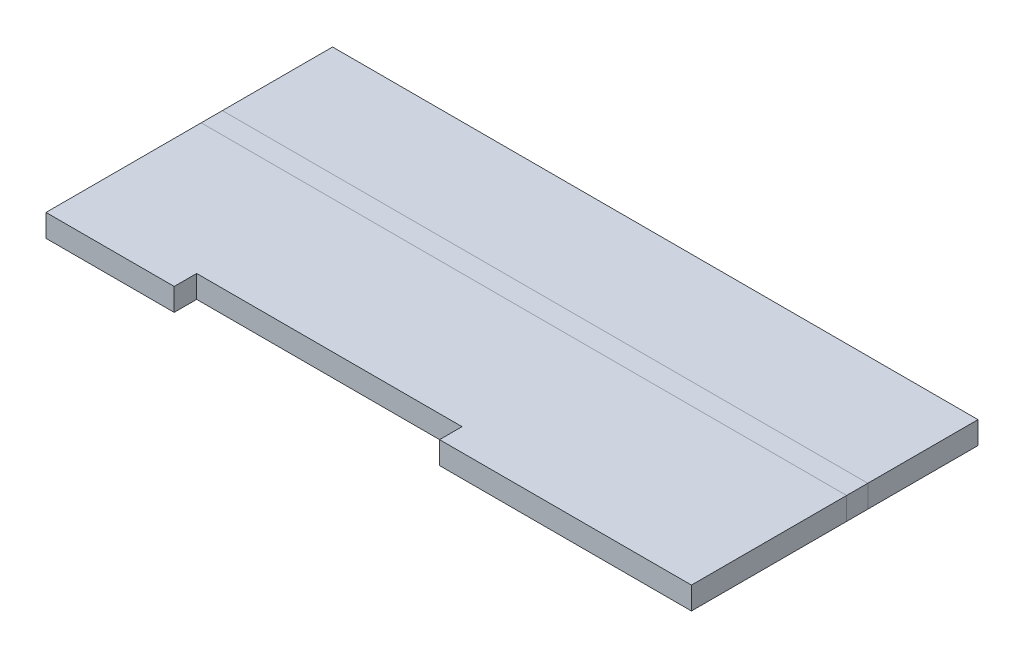
ISO-10303-21;
HEADER;
FILE_DESCRIPTION(('STEP AP214'),'2;1');
FILE_NAME('part.step','',(''),(''),'','','');
FILE_SCHEMA(('AUTOMOTIVE_DESIGN { 1 0 10303 214 1 1 1 1 }'));
ENDSEC;
DATA;
#1=APPLICATION_CONTEXT('core data for automotive mechanical design processes');
#2=APPLICATION_PROTOCOL_DEFINITION('international standard','automotive_design',2000,#1);
#3=PRODUCT_CONTEXT('',#1,'mechanical');
#4=PRODUCT('Part','Part','',(#3));
#5=PRODUCT_RELATED_PRODUCT_CATEGORY('part','',(#4));
#6=PRODUCT_DEFINITION_FORMATION('','',#4);
#7=PRODUCT_DEFINITION_CONTEXT('part definition',#1,'design');
#8=PRODUCT_DEFINITION('design','',#6,#7);
#9=PRODUCT_DEFINITION_SHAPE('','',#8);
#10=(LENGTH_UNIT() NAMED_UNIT(*) SI_UNIT(.MILLI.,.METRE.));
#11=(NAMED_UNIT(*) PLANE_ANGLE_UNIT() SI_UNIT($,.RADIAN.));
#12=(NAMED_UNIT(*) SI_UNIT($,.STERADIAN.) SOLID_ANGLE_UNIT());
#13=UNCERTAINTY_MEASURE_WITH_UNIT(LENGTH_MEASURE(1.E-05),#10,'distance_accuracy_value','');
#14=(GEOMETRIC_REPRESENTATION_CONTEXT(3) GLOBAL_UNCERTAINTY_ASSIGNED_CONTEXT((#13)) GLOBAL_UNIT_ASSIGNED_CONTEXT((#10,
#11,#12)) REPRESENTATION_CONTEXT('',''));
#15=CARTESIAN_POINT('',(0.,0.,0.));
#16=DIRECTION('',(0.,0.,1.));
#17=DIRECTION('',(1.,0.,0.));
#18=AXIS2_PLACEMENT_3D('',#15,#16,#17);
#19=CARTESIAN_POINT('',(3.6449,2.032,1.71258936020354));
#20=DIRECTION('',(0.,0.,-1.));
#21=DIRECTION('',(-1.,0.,0.));
#22=AXIS2_PLACEMENT_3D('',#19,#20,#21);
#23=PLANE('',#22);
#24=DIRECTION('',(0.,1.,0.));
#25=VECTOR('',#24,1.);
#26=CARTESIAN_POINT('',(-3.6449,2.032,1.71258936020354));
#27=LINE('',#26,#25);
#28=CARTESIAN_POINT('',(-3.6449,1.778,1.71258936020354));
#29=VERTEX_POINT('',#28);
#30=CARTESIAN_POINT('',(-3.6449,2.032,1.71258936020354));
#31=VERTEX_POINT('',#30);
#32=EDGE_CURVE('E87',#29,#31,#27,.T.);
#33=ORIENTED_EDGE('',*,*,#32,.F.);
#34=DIRECTION('',(1.,0.,0.));
#35=VECTOR('',#34,1.);
#36=CARTESIAN_POINT('',(3.6449,1.778,1.71258936020354));
#37=LINE('',#36,#35);
#38=CARTESIAN_POINT('',(-2.19710000000001,1.778,1.71258936020354));
#39=VERTEX_POINT('',#38);
#40=EDGE_CURVE('E89',#39,#29,#37,.F.);
#41=ORIENTED_EDGE('',*,*,#40,.F.);
#42=DIRECTION('',(0.,1.,0.));
#43=VECTOR('',#42,1.);
#44=CARTESIAN_POINT('',(-2.19710000000001,2.032,1.71258936020354));
#45=LINE('',#44,#43);
#46=CARTESIAN_POINT('',(-2.19710000000001,2.032,1.71258936020354));
#47=VERTEX_POINT('',#46);
#48=EDGE_CURVE('E58',#39,#47,#45,.T.);
#49=ORIENTED_EDGE('',*,*,#48,.T.);
#50=DIRECTION('',(-1.,0.,0.));
#51=VECTOR('',#50,1.);
#52=CARTESIAN_POINT('',(3.6449,2.032,1.71258936020354));
#53=LINE('',#52,#51);
#54=EDGE_CURVE('E90',#47,#31,#53,.T.);
#55=ORIENTED_EDGE('',*,*,#54,.T.);
#56=EDGE_LOOP('',(#33,#41,#49,#55));
#57=FACE_BOUND('',#56,.T.);
#58=ADVANCED_FACE('F41',(#57),#23,.F.);
#59=CARTESIAN_POINT('',(-2.19710000000001,2.032,1.71258936020354));
#60=DIRECTION('',(1.,0.,0.));
#61=DIRECTION('',(0.,0.,-1.));
#62=AXIS2_PLACEMENT_3D('',#59,#60,#61);
#63=PLANE('',#62);
#64=ORIENTED_EDGE('',*,*,#48,.F.);
#65=DIRECTION('',(0.,0.,-1.));
#66=VECTOR('',#65,1.);
#67=CARTESIAN_POINT('',(-2.19710000000001,1.778,1.71258936020354));
#68=LINE('',#67,#66);
#69=CARTESIAN_POINT('',(-2.19710000000001,1.778,1.45858936020354));
#70=VERTEX_POINT('',#69);
#71=EDGE_CURVE('E105',#39,#70,#68,.T.);
#72=ORIENTED_EDGE('',*,*,#71,.T.);
#73=DIRECTION('',(0.,1.,0.));
#74=VECTOR('',#73,1.);
#75=CARTESIAN_POINT('',(-2.19710000000001,2.032,1.45858936020354));
#76=LINE('',#75,#74);
#77=CARTESIAN_POINT('',(-2.19710000000001,2.032,1.45858936020354));
#78=VERTEX_POINT('',#77);
#79=EDGE_CURVE('E124',#70,#78,#76,.T.);
#80=ORIENTED_EDGE('',*,*,#79,.T.);
#81=DIRECTION('',(0.,0.,-1.));
#82=VECTOR('',#81,1.);
#83=CARTESIAN_POINT('',(-2.19710000000001,2.032,1.71258936020354));
#84=LINE('',#83,#82);
#85=EDGE_CURVE('E106',#47,#78,#84,.T.);
#86=ORIENTED_EDGE('',*,*,#85,.F.);
#87=EDGE_LOOP('',(#64,#72,#80,#86));
#88=FACE_BOUND('',#87,.T.);
#89=ADVANCED_FACE('F214',(#88),#63,.T.);
#90=CARTESIAN_POINT('',(0.800099999999993,2.032,1.45858936020354));
#91=DIRECTION('',(0.,0.,1.));
#92=DIRECTION('',(1.,0.,0.));
#93=AXIS2_PLACEMENT_3D('',#90,#91,#92);
#94=PLANE('',#93);
#95=ORIENTED_EDGE('',*,*,#79,.F.);
#96=DIRECTION('',(1.,0.,0.));
#97=VECTOR('',#96,1.);
#98=CARTESIAN_POINT('',(3.6449,1.778,1.45858936020354));
#99=LINE('',#98,#97);
#100=CARTESIAN_POINT('',(0.800099999999993,1.778,1.45858936020354));
#101=VERTEX_POINT('',#100);
#102=EDGE_CURVE('E212',#70,#101,#99,.T.);
#103=ORIENTED_EDGE('',*,*,#102,.T.);
#104=DIRECTION('',(0.,1.,0.));
#105=VECTOR('',#104,1.);
#106=CARTESIAN_POINT('',(0.800099999999993,2.032,1.45858936020354));
#107=LINE('',#106,#105);
#108=CARTESIAN_POINT('',(0.800099999999993,2.032,1.45858936020354));
#109=VERTEX_POINT('',#108);
#110=EDGE_CURVE('E121',#101,#109,#107,.T.);
#111=ORIENTED_EDGE('',*,*,#110,.T.);
#112=DIRECTION('',(1.,0.,0.));
#113=VECTOR('',#112,1.);
#114=CARTESIAN_POINT('',(0.800099999999993,2.032,1.45858936020354));
#115=LINE('',#114,#113);
#116=EDGE_CURVE('E193',#78,#109,#115,.T.);
#117=ORIENTED_EDGE('',*,*,#116,.F.);
#118=EDGE_LOOP('',(#95,#103,#111,#117));
#119=FACE_BOUND('',#118,.T.);
#120=ADVANCED_FACE('F220',(#119),#94,.T.);
#121=CARTESIAN_POINT('',(0.800099999999993,2.032,1.71258936020354));
#122=DIRECTION('',(-1.,0.,0.));
#123=DIRECTION('',(0.,0.,1.));
#124=AXIS2_PLACEMENT_3D('',#121,#122,#123);
#125=PLANE('',#124);
#126=ORIENTED_EDGE('',*,*,#110,.F.);
#127=DIRECTION('',(0.,0.,-1.));
#128=VECTOR('',#127,1.);
#129=CARTESIAN_POINT('',(0.800099999999993,1.778,1.71258936020354));
#130=LINE('',#129,#128);
#131=CARTESIAN_POINT('',(0.800099999999993,1.778,1.71258936020354));
#132=VERTEX_POINT('',#131);
#133=EDGE_CURVE('E209',#101,#132,#130,.F.);
#134=ORIENTED_EDGE('',*,*,#133,.T.);
#135=DIRECTION('',(0.,1.,0.));
#136=VECTOR('',#135,1.);
#137=CARTESIAN_POINT('',(0.800099999999993,2.032,1.71258936020354));
#138=LINE('',#137,#136);
#139=CARTESIAN_POINT('',(0.800099999999993,2.032,1.71258936020354));
#140=VERTEX_POINT('',#139);
#141=EDGE_CURVE('E118',#132,#140,#138,.T.);
#142=ORIENTED_EDGE('',*,*,#141,.T.);
#143=DIRECTION('',(0.,0.,1.));
#144=VECTOR('',#143,1.);
#145=CARTESIAN_POINT('',(0.800099999999993,2.032,1.71258936020354));
#146=LINE('',#145,#144);
#147=EDGE_CURVE('E196',#109,#140,#146,.T.);
#148=ORIENTED_EDGE('',*,*,#147,.F.);
#149=EDGE_LOOP('',(#126,#134,#142,#148));
#150=FACE_BOUND('',#149,.T.);
#151=ADVANCED_FACE('F225',(#150),#125,.T.);
#152=ORIENTED_EDGE('',*,*,#141,.F.);
#153=DIRECTION('',(1.,0.,0.));
#154=VECTOR('',#153,1.);
#155=CARTESIAN_POINT('',(3.6449,1.778,1.71258936020354));
#156=LINE('',#155,#154);
#157=CARTESIAN_POINT('',(3.6449,1.778,1.71258936020354));
#158=VERTEX_POINT('',#157);
#159=EDGE_CURVE('E111',#158,#132,#156,.F.);
#160=ORIENTED_EDGE('',*,*,#159,.F.);
#161=DIRECTION('',(0.,1.,0.));
#162=VECTOR('',#161,1.);
#163=CARTESIAN_POINT('',(3.6449,2.032,1.71258936020354));
#164=LINE('',#163,#162);
#165=CARTESIAN_POINT('',(3.6449,2.032,1.71258936020354));
#166=VERTEX_POINT('',#165);
#167=EDGE_CURVE('E115',#158,#166,#164,.T.);
#168=ORIENTED_EDGE('',*,*,#167,.T.);
#169=EDGE_CURVE('E199',#166,#140,#53,.T.);
#170=ORIENTED_EDGE('',*,*,#169,.T.);
#171=EDGE_LOOP('',(#152,#160,#168,#170));
#172=FACE_BOUND('',#171,.T.);
#173=ADVANCED_FACE('F228',(#172),#23,.F.);
#174=CARTESIAN_POINT('',(3.6449,2.032,1.71258936020354));
#175=DIRECTION('',(1.,0.,0.));
#176=DIRECTION('',(0.,0.,-1.));
#177=AXIS2_PLACEMENT_3D('',#174,#175,#176);
#178=PLANE('',#177);
#179=ORIENTED_EDGE('',*,*,#167,.F.);
#180=DIRECTION('',(0.,0.,-1.));
#181=VECTOR('',#180,1.);
#182=CARTESIAN_POINT('',(3.6449,1.778,1.71258936020354));
#183=LINE('',#182,#181);
#184=CARTESIAN_POINT('',(3.6449,1.778,-0.0400106397964576));
#185=VERTEX_POINT('',#184);
#186=EDGE_CURVE('E108',#158,#185,#183,.T.);
#187=ORIENTED_EDGE('',*,*,#186,.T.);
#188=DIRECTION('',(0.,1.,0.));
#189=VECTOR('',#188,1.);
#190=CARTESIAN_POINT('',(3.6449,2.032,-0.040010639796458));
#191=LINE('',#190,#189);
#192=CARTESIAN_POINT('',(3.6449,2.032,-0.0400106397964575));
#193=VERTEX_POINT('',#192);
#194=EDGE_CURVE('E129',#185,#193,#191,.T.);
#195=ORIENTED_EDGE('',*,*,#194,.T.);
#196=DIRECTION('',(0.,0.,-1.));
#197=VECTOR('',#196,1.);
#198=CARTESIAN_POINT('',(3.6449,2.032,1.71258936020354));
#199=LINE('',#198,#197);
#200=EDGE_CURVE('E202',#166,#193,#199,.T.);
#201=ORIENTED_EDGE('',*,*,#200,.F.);
#202=EDGE_LOOP('',(#179,#187,#195,#201));
#203=FACE_BOUND('',#202,.T.);
#204=ADVANCED_FACE('F236',(#203),#178,.T.);
#205=CARTESIAN_POINT('',(-3.6449,2.032,1.71258936020354));
#206=DIRECTION('',(1.,0.,0.));
#207=DIRECTION('',(0.,0.,-1.));
#208=AXIS2_PLACEMENT_3D('',#205,#206,#207);
#209=PLANE('',#208);
#210=DIRECTION('',(0.,0.,-1.));
#211=VECTOR('',#210,1.);
#212=CARTESIAN_POINT('',(-3.6449,1.778,1.71258936020354));
#213=LINE('',#212,#211);
#214=CARTESIAN_POINT('',(-3.6449,1.778,-0.0400106397964576));
#215=VERTEX_POINT('',#214);
#216=EDGE_CURVE('E102',#29,#215,#213,.T.);
#217=ORIENTED_EDGE('',*,*,#216,.F.);
#218=ORIENTED_EDGE('',*,*,#32,.T.);
#219=DIRECTION('',(0.,0.,-1.));
#220=VECTOR('',#219,1.);
#221=CARTESIAN_POINT('',(-3.6449,2.032,1.71258936020354));
#222=LINE('',#221,#220);
#223=CARTESIAN_POINT('',(-3.6449,2.032,-0.040010639796458));
#224=VERTEX_POINT('',#223);
#225=EDGE_CURVE('E205',#31,#224,#222,.T.);
#226=ORIENTED_EDGE('',*,*,#225,.T.);
#227=DIRECTION('',(0.,1.,0.));
#228=VECTOR('',#227,1.);
#229=CARTESIAN_POINT('',(-3.6449,2.032,-0.040010639796458));
#230=LINE('',#229,#228);
#231=EDGE_CURVE('E11',#215,#224,#230,.T.);
#232=ORIENTED_EDGE('',*,*,#231,.F.);
#233=EDGE_LOOP('',(#217,#218,#226,#232));
#234=FACE_BOUND('',#233,.T.);
#235=ADVANCED_FACE('F43',(#234),#209,.F.);
#236=CARTESIAN_POINT('',(3.6449,2.032,1.71258936020354));
#237=DIRECTION('',(0.,1.,0.));
#238=DIRECTION('',(1.,0.,0.));
#239=AXIS2_PLACEMENT_3D('',#236,#237,#238);
#240=PLANE('',#239);
#241=ORIENTED_EDGE('',*,*,#85,.T.);
#242=ORIENTED_EDGE('',*,*,#116,.T.);
#243=ORIENTED_EDGE('',*,*,#147,.T.);
#244=ORIENTED_EDGE('',*,*,#169,.F.);
#245=ORIENTED_EDGE('',*,*,#200,.T.);
#246=DIRECTION('',(-1.,0.,0.));
#247=VECTOR('',#246,1.);
#248=CARTESIAN_POINT('',(3.6449,2.032,-0.040010639796458));
#249=LINE('',#248,#247);
#250=EDGE_CURVE('E95',#193,#224,#249,.T.);
#251=ORIENTED_EDGE('',*,*,#250,.T.);
#252=ORIENTED_EDGE('',*,*,#225,.F.);
#253=ORIENTED_EDGE('',*,*,#54,.F.);
#254=EDGE_LOOP('',(#241,#242,#243,#244,#245,#251,#252,#253));
#255=FACE_BOUND('',#254,.T.);
#256=ADVANCED_FACE('F218',(#255),#240,.T.);
#257=CARTESIAN_POINT('',(3.6449,1.778,1.71258936020354));
#258=DIRECTION('',(0.,1.,0.));
#259=DIRECTION('',(1.,0.,0.));
#260=AXIS2_PLACEMENT_3D('',#257,#258,#259);
#261=PLANE('',#260);
#262=ORIENTED_EDGE('',*,*,#71,.F.);
#263=ORIENTED_EDGE('',*,*,#40,.T.);
#264=ORIENTED_EDGE('',*,*,#216,.T.);
#265=DIRECTION('',(-1.,0.,0.));
#266=VECTOR('',#265,1.);
#267=CARTESIAN_POINT('',(3.6449,1.778,-0.040010639796458));
#268=LINE('',#267,#266);
#269=EDGE_CURVE('E50',#185,#215,#268,.T.);
#270=ORIENTED_EDGE('',*,*,#269,.F.);
#271=ORIENTED_EDGE('',*,*,#186,.F.);
#272=ORIENTED_EDGE('',*,*,#159,.T.);
#273=ORIENTED_EDGE('',*,*,#133,.F.);
#274=ORIENTED_EDGE('',*,*,#102,.F.);
#275=EDGE_LOOP('',(#262,#263,#264,#270,#271,#272,#273,#274));
#276=FACE_BOUND('',#275,.T.);
#277=ADVANCED_FACE('F99',(#276),#261,.F.);
#278=CARTESIAN_POINT('',(3.6449,2.032,-1.524));
#279=DIRECTION('',(0.,0.,-1.));
#280=DIRECTION('',(-1.,0.,0.));
#281=AXIS2_PLACEMENT_3D('',#278,#279,#280);
#282=PLANE('',#281);
#283=DIRECTION('',(0.,1.,0.));
#284=VECTOR('',#283,1.);
#285=CARTESIAN_POINT('',(3.6449,2.032,-1.524));
#286=LINE('',#285,#284);
#287=CARTESIAN_POINT('',(3.6449,1.778,-1.524));
#288=VERTEX_POINT('',#287);
#289=CARTESIAN_POINT('',(3.6449,2.032,-1.524));
#290=VERTEX_POINT('',#289);
#291=EDGE_CURVE('E166',#288,#290,#286,.T.);
#292=ORIENTED_EDGE('',*,*,#291,.F.);
#293=DIRECTION('',(1.,0.,0.));
#294=VECTOR('',#293,1.);
#295=CARTESIAN_POINT('',(3.6449,1.778,-1.524));
#296=LINE('',#295,#294);
#297=CARTESIAN_POINT('',(-3.6449,1.778,-1.524));
#298=VERTEX_POINT('',#297);
#299=EDGE_CURVE('E181',#288,#298,#296,.F.);
#300=ORIENTED_EDGE('',*,*,#299,.T.);
#301=DIRECTION('',(0.,1.,0.));
#302=VECTOR('',#301,1.);
#303=CARTESIAN_POINT('',(-3.6449,2.032,-1.524));
#304=LINE('',#303,#302);
#305=CARTESIAN_POINT('',(-3.6449,2.032,-1.524));
#306=VERTEX_POINT('',#305);
#307=EDGE_CURVE('E178',#298,#306,#304,.T.);
#308=ORIENTED_EDGE('',*,*,#307,.T.);
#309=DIRECTION('',(-1.,0.,0.));
#310=VECTOR('',#309,1.);
#311=CARTESIAN_POINT('',(3.6449,2.032,-1.524));
#312=LINE('',#311,#310);
#313=EDGE_CURVE('E172',#290,#306,#312,.T.);
#314=ORIENTED_EDGE('',*,*,#313,.F.);
#315=EDGE_LOOP('',(#292,#300,#308,#314));
#316=FACE_BOUND('',#315,.T.);
#317=ADVANCED_FACE('F278',(#316),#282,.T.);
#318=CARTESIAN_POINT('',(3.6449,2.032,-0.2794));
#319=DIRECTION('',(0.,1.,0.));
#320=DIRECTION('',(0.,0.,1.));
#321=AXIS2_PLACEMENT_3D('',#318,#319,#320);
#322=PLANE('',#321);
#323=DIRECTION('',(0.,0.,-1.));
#324=VECTOR('',#323,1.);
#325=CARTESIAN_POINT('',(-3.6449,2.032,-0.2794));
#326=LINE('',#325,#324);
#327=CARTESIAN_POINT('',(-3.6449,2.032,-0.2794));
#328=VERTEX_POINT('',#327);
#329=EDGE_CURVE('E156',#328,#306,#326,.T.);
#330=ORIENTED_EDGE('',*,*,#329,.F.);
#331=DIRECTION('',(-1.,0.,0.));
#332=VECTOR('',#331,1.);
#333=CARTESIAN_POINT('',(3.6449,2.032,-0.2794));
#334=LINE('',#333,#332);
#335=CARTESIAN_POINT('',(3.6449,2.032,-0.2794));
#336=VERTEX_POINT('',#335);
#337=EDGE_CURVE('E187',#336,#328,#334,.T.);
#338=ORIENTED_EDGE('',*,*,#337,.F.);
#339=DIRECTION('',(0.,0.,-1.));
#340=VECTOR('',#339,1.);
#341=CARTESIAN_POINT('',(3.6449,2.032,-0.2794));
#342=LINE('',#341,#340);
#343=EDGE_CURVE('E175',#336,#290,#342,.T.);
#344=ORIENTED_EDGE('',*,*,#343,.T.);
#345=ORIENTED_EDGE('',*,*,#313,.T.);
#346=EDGE_LOOP('',(#330,#338,#344,#345));
#347=FACE_BOUND('',#346,.T.);
#348=ADVANCED_FACE('F271',(#347),#322,.T.);
#349=CARTESIAN_POINT('',(3.6449,2.032,-0.2794));
#350=DIRECTION('',(1.,0.,0.));
#351=DIRECTION('',(0.,0.,-1.));
#352=AXIS2_PLACEMENT_3D('',#349,#350,#351);
#353=PLANE('',#352);
#354=DIRECTION('',(0.,1.,0.));
#355=VECTOR('',#354,1.);
#356=CARTESIAN_POINT('',(3.6449,2.032,-0.2794));
#357=LINE('',#356,#355);
#358=CARTESIAN_POINT('',(3.6449,1.778,-0.2794));
#359=VERTEX_POINT('',#358);
#360=EDGE_CURVE('E184',#359,#336,#357,.T.);
#361=ORIENTED_EDGE('',*,*,#360,.F.);
#362=DIRECTION('',(0.,0.,1.));
#363=VECTOR('',#362,1.);
#364=CARTESIAN_POINT('',(3.6449,1.778,-0.2794));
#365=LINE('',#364,#363);
#366=EDGE_CURVE('E169',#359,#288,#365,.F.);
#367=ORIENTED_EDGE('',*,*,#366,.T.);
#368=ORIENTED_EDGE('',*,*,#291,.T.);
#369=ORIENTED_EDGE('',*,*,#343,.F.);
#370=EDGE_LOOP('',(#361,#367,#368,#369));
#371=FACE_BOUND('',#370,.T.);
#372=ADVANCED_FACE('F275',(#371),#353,.T.);
#373=CARTESIAN_POINT('',(3.6449,1.778,-0.2794));
#374=DIRECTION('',(0.,1.,0.));
#375=DIRECTION('',(0.,0.,1.));
#376=AXIS2_PLACEMENT_3D('',#373,#374,#375);
#377=PLANE('',#376);
#378=DIRECTION('',(0.,0.,1.));
#379=VECTOR('',#378,1.);
#380=CARTESIAN_POINT('',(-3.6449,1.778,-0.2794));
#381=LINE('',#380,#379);
#382=CARTESIAN_POINT('',(-3.6449,1.778,-0.2794));
#383=VERTEX_POINT('',#382);
#384=EDGE_CURVE('E163',#383,#298,#381,.F.);
#385=ORIENTED_EDGE('',*,*,#384,.T.);
#386=ORIENTED_EDGE('',*,*,#299,.F.);
#387=ORIENTED_EDGE('',*,*,#366,.F.);
#388=DIRECTION('',(-1.,0.,0.));
#389=VECTOR('',#388,1.);
#390=CARTESIAN_POINT('',(3.6449,1.778,-0.2794));
#391=LINE('',#390,#389);
#392=EDGE_CURVE('E160',#359,#383,#391,.T.);
#393=ORIENTED_EDGE('',*,*,#392,.T.);
#394=EDGE_LOOP('',(#385,#386,#387,#393));
#395=FACE_BOUND('',#394,.T.);
#396=ADVANCED_FACE('F280',(#395),#377,.F.);
#397=CARTESIAN_POINT('',(-3.6449,2.032,-0.2794));
#398=DIRECTION('',(1.,0.,0.));
#399=DIRECTION('',(0.,0.,-1.));
#400=AXIS2_PLACEMENT_3D('',#397,#398,#399);
#401=PLANE('',#400);
#402=ORIENTED_EDGE('',*,*,#307,.F.);
#403=ORIENTED_EDGE('',*,*,#384,.F.);
#404=DIRECTION('',(0.,1.,0.));
#405=VECTOR('',#404,1.);
#406=CARTESIAN_POINT('',(-3.6449,2.032,-0.2794));
#407=LINE('',#406,#405);
#408=EDGE_CURVE('E150',#383,#328,#407,.T.);
#409=ORIENTED_EDGE('',*,*,#408,.T.);
#410=ORIENTED_EDGE('',*,*,#329,.T.);
#411=EDGE_LOOP('',(#402,#403,#409,#410));
#412=FACE_BOUND('',#411,.T.);
#413=ADVANCED_FACE('F282',(#412),#401,.F.);
#414=CARTESIAN_POINT('',(-3.6449,2.032,-0.0400106397964575));
#415=DIRECTION('',(-1.,0.,0.));
#416=DIRECTION('',(0.,0.,1.));
#417=AXIS2_PLACEMENT_3D('',#414,#415,#416);
#418=PLANE('',#417);
#419=ORIENTED_EDGE('',*,*,#408,.F.);
#420=DIRECTION('',(0.,0.,1.));
#421=VECTOR('',#420,1.);
#422=CARTESIAN_POINT('',(-3.6449,1.778,-0.159705319898229));
#423=LINE('',#422,#421);
#424=EDGE_CURVE('E139',#383,#215,#423,.T.);
#425=ORIENTED_EDGE('',*,*,#424,.T.);
#426=ORIENTED_EDGE('',*,*,#231,.T.);
#427=DIRECTION('',(0.,0.,1.));
#428=VECTOR('',#427,1.);
#429=CARTESIAN_POINT('',(-3.6449,2.032,-0.0400106397964575));
#430=LINE('',#429,#428);
#431=EDGE_CURVE('E152',#328,#224,#430,.T.);
#432=ORIENTED_EDGE('',*,*,#431,.F.);
#433=EDGE_LOOP('',(#419,#425,#426,#432));
#434=FACE_BOUND('',#433,.T.);
#435=ADVANCED_FACE('F147',(#434),#418,.T.);
#436=CARTESIAN_POINT('',(3.6449,2.032,-0.0400106397964575));
#437=DIRECTION('',(1.,0.,0.));
#438=DIRECTION('',(0.,0.,-1.));
#439=AXIS2_PLACEMENT_3D('',#436,#437,#438);
#440=PLANE('',#439);
#441=ORIENTED_EDGE('',*,*,#194,.F.);
#442=DIRECTION('',(0.,0.,1.));
#443=VECTOR('',#442,1.);
#444=CARTESIAN_POINT('',(3.6449,1.778,-0.159705319898229));
#445=LINE('',#444,#443);
#446=EDGE_CURVE('E142',#185,#359,#445,.F.);
#447=ORIENTED_EDGE('',*,*,#446,.T.);
#448=ORIENTED_EDGE('',*,*,#360,.T.);
#449=DIRECTION('',(0.,0.,-1.));
#450=VECTOR('',#449,1.);
#451=CARTESIAN_POINT('',(3.6449,2.032,-0.0400106397964575));
#452=LINE('',#451,#450);
#453=EDGE_CURVE('E190',#193,#336,#452,.T.);
#454=ORIENTED_EDGE('',*,*,#453,.F.);
#455=EDGE_LOOP('',(#441,#447,#448,#454));
#456=FACE_BOUND('',#455,.T.);
#457=ADVANCED_FACE('F243',(#456),#440,.T.);
#458=CARTESIAN_POINT('',(0.,2.032,-0.159705319898229));
#459=DIRECTION('',(0.,1.,0.));
#460=DIRECTION('',(0.,0.,1.));
#461=AXIS2_PLACEMENT_3D('',#458,#459,#460);
#462=PLANE('',#461);
#463=ORIENTED_EDGE('',*,*,#453,.T.);
#464=ORIENTED_EDGE('',*,*,#337,.T.);
#465=ORIENTED_EDGE('',*,*,#431,.T.);
#466=ORIENTED_EDGE('',*,*,#250,.F.);
#467=EDGE_LOOP('',(#463,#464,#465,#466));
#468=FACE_BOUND('',#467,.T.);
#469=ADVANCED_FACE('F266',(#468),#462,.T.);
#470=CARTESIAN_POINT('',(0.,1.778,-0.159705319898229));
#471=DIRECTION('',(0.,1.,0.));
#472=DIRECTION('',(0.,0.,1.));
#473=AXIS2_PLACEMENT_3D('',#470,#471,#472);
#474=PLANE('',#473);
#475=ORIENTED_EDGE('',*,*,#446,.F.);
#476=ORIENTED_EDGE('',*,*,#269,.T.);
#477=ORIENTED_EDGE('',*,*,#424,.F.);
#478=ORIENTED_EDGE('',*,*,#392,.F.);
#479=EDGE_LOOP('',(#475,#476,#477,#478));
#480=FACE_BOUND('',#479,.T.);
#481=ADVANCED_FACE('F136',(#480),#474,.F.);
#482=CLOSED_SHELL('',(#58,#89,#120,#151,#173,#204,#235,#256,#277,#317,#348,#372,#396,#413,#435,
#457,#469,#481));
#483=MANIFOLD_SOLID_BREP('B2',#482);
#484=ADVANCED_BREP_SHAPE_REPRESENTATION('',(#18,#483),#14);
#485=SHAPE_DEFINITION_REPRESENTATION(#9,#484);
ENDSEC;
END-ISO-10303-21;
